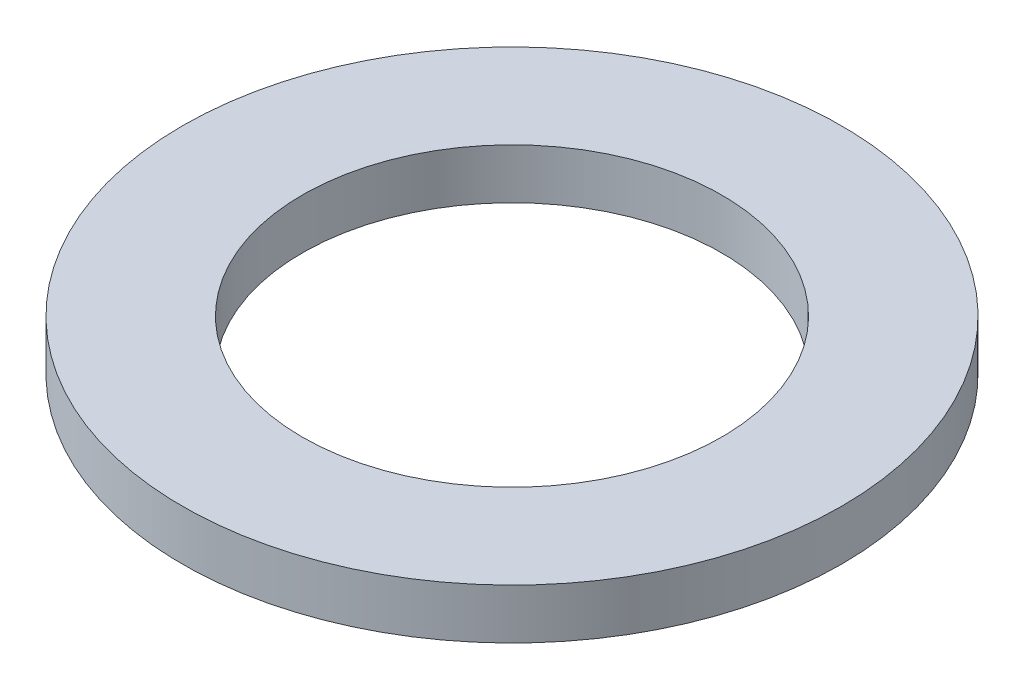
ISO-10303-21;
HEADER;
FILE_DESCRIPTION(('STEP AP214'),'2;1');
FILE_NAME('part.step','',(''),(''),'','','');
FILE_SCHEMA(('AUTOMOTIVE_DESIGN { 1 0 10303 214 1 1 1 1 }'));
ENDSEC;
DATA;
#1=APPLICATION_CONTEXT('core data for automotive mechanical design processes');
#2=APPLICATION_PROTOCOL_DEFINITION('international standard','automotive_design',2000,#1);
#3=PRODUCT_CONTEXT('',#1,'mechanical');
#4=PRODUCT('Part','Part','',(#3));
#5=PRODUCT_RELATED_PRODUCT_CATEGORY('part','',(#4));
#6=PRODUCT_DEFINITION_FORMATION('','',#4);
#7=PRODUCT_DEFINITION_CONTEXT('part definition',#1,'design');
#8=PRODUCT_DEFINITION('design','',#6,#7);
#9=PRODUCT_DEFINITION_SHAPE('','',#8);
#10=(LENGTH_UNIT() NAMED_UNIT(*) SI_UNIT(.MILLI.,.METRE.));
#11=(NAMED_UNIT(*) PLANE_ANGLE_UNIT() SI_UNIT($,.RADIAN.));
#12=(NAMED_UNIT(*) SI_UNIT($,.STERADIAN.) SOLID_ANGLE_UNIT());
#13=UNCERTAINTY_MEASURE_WITH_UNIT(LENGTH_MEASURE(1.E-05),#10,'distance_accuracy_value','');
#14=(GEOMETRIC_REPRESENTATION_CONTEXT(3) GLOBAL_UNCERTAINTY_ASSIGNED_CONTEXT((#13)) GLOBAL_UNIT_ASSIGNED_CONTEXT((#10,
#11,#12)) REPRESENTATION_CONTEXT('',''));
#15=CARTESIAN_POINT('',(0.,0.,0.));
#16=DIRECTION('',(0.,0.,1.));
#17=DIRECTION('',(1.,0.,0.));
#18=AXIS2_PLACEMENT_3D('',#15,#16,#17);
#19=CARTESIAN_POINT('',(0.,3.35,0.));
#20=DIRECTION('',(0.,1.,0.));
#21=DIRECTION('',(0.,0.,1.));
#22=AXIS2_PLACEMENT_3D('',#19,#20,#21);
#23=PLANE('',#22);
#24=CARTESIAN_POINT('',(0.,3.35,0.));
#25=DIRECTION('',(0.,1.,0.));
#26=DIRECTION('',(1.,0.,0.));
#27=AXIS2_PLACEMENT_3D('',#24,#25,#26);
#28=CIRCLE('',#27,22.);
#29=CARTESIAN_POINT('',(22.,3.35,0.));
#30=VERTEX_POINT('',#29);
#31=EDGE_CURVE('E11',#30,#30,#28,.T.);
#32=ORIENTED_EDGE('',*,*,#31,.T.);
#33=EDGE_LOOP('',(#32));
#34=FACE_BOUND('',#33,.T.);
#35=CARTESIAN_POINT('',(0.,3.35,0.));
#36=DIRECTION('',(0.,1.,0.));
#37=DIRECTION('',(0.,0.,1.));
#38=AXIS2_PLACEMENT_3D('',#35,#36,#37);
#39=CIRCLE('',#38,14.);
#40=CARTESIAN_POINT('',(0.,3.35,14.));
#41=VERTEX_POINT('',#40);
#42=EDGE_CURVE('E60',#41,#41,#39,.T.);
#43=ORIENTED_EDGE('',*,*,#42,.F.);
#44=EDGE_LOOP('',(#43));
#45=FACE_BOUND('',#44,.T.);
#46=ADVANCED_FACE('F47',(#34,#45),#23,.T.);
#47=CARTESIAN_POINT('',(0.,0.,0.));
#48=DIRECTION('',(0.,1.,0.));
#49=DIRECTION('',(0.,0.,1.));
#50=AXIS2_PLACEMENT_3D('',#47,#48,#49);
#51=PLANE('',#50);
#52=CARTESIAN_POINT('',(0.,0.,0.));
#53=DIRECTION('',(0.,1.,0.));
#54=DIRECTION('',(1.,0.,0.));
#55=AXIS2_PLACEMENT_3D('',#52,#53,#54);
#56=CIRCLE('',#55,22.);
#57=CARTESIAN_POINT('',(22.,0.,0.));
#58=VERTEX_POINT('',#57);
#59=EDGE_CURVE('E51',#58,#58,#56,.T.);
#60=ORIENTED_EDGE('',*,*,#59,.F.);
#61=EDGE_LOOP('',(#60));
#62=FACE_BOUND('',#61,.T.);
#63=CARTESIAN_POINT('',(0.,0.,0.));
#64=DIRECTION('',(0.,1.,0.));
#65=DIRECTION('',(0.,0.,1.));
#66=AXIS2_PLACEMENT_3D('',#63,#64,#65);
#67=CIRCLE('',#66,14.);
#68=CARTESIAN_POINT('',(0.,0.,14.));
#69=VERTEX_POINT('',#68);
#70=EDGE_CURVE('E62',#69,#69,#67,.T.);
#71=ORIENTED_EDGE('',*,*,#70,.T.);
#72=EDGE_LOOP('',(#71));
#73=FACE_BOUND('',#72,.T.);
#74=ADVANCED_FACE('F74',(#62,#73),#51,.F.);
#75=CARTESIAN_POINT('',(0.,3.35,0.));
#76=DIRECTION('',(0.,-1.,0.));
#77=DIRECTION('',(0.,0.,-1.));
#78=AXIS2_PLACEMENT_3D('',#75,#76,#77);
#79=CYLINDRICAL_SURFACE('',#78,22.);
#80=ORIENTED_EDGE('',*,*,#31,.F.);
#81=EDGE_LOOP('',(#80));
#82=FACE_BOUND('',#81,.T.);
#83=ORIENTED_EDGE('',*,*,#59,.T.);
#84=EDGE_LOOP('',(#83));
#85=FACE_BOUND('',#84,.T.);
#86=ADVANCED_FACE('F49',(#82,#85),#79,.T.);
#87=CARTESIAN_POINT('',(0.,3.35,0.));
#88=DIRECTION('',(0.,-1.,0.));
#89=DIRECTION('',(0.,0.,-1.));
#90=AXIS2_PLACEMENT_3D('',#87,#88,#89);
#91=CYLINDRICAL_SURFACE('',#90,14.);
#92=ORIENTED_EDGE('',*,*,#42,.T.);
#93=EDGE_LOOP('',(#92));
#94=FACE_BOUND('',#93,.T.);
#95=ORIENTED_EDGE('',*,*,#70,.F.);
#96=EDGE_LOOP('',(#95));
#97=FACE_BOUND('',#96,.T.);
#98=ADVANCED_FACE('F70',(#94,#97),#91,.F.);
#99=CLOSED_SHELL('',(#46,#74,#86,#98));
#100=MANIFOLD_SOLID_BREP('B2',#99);
#101=ADVANCED_BREP_SHAPE_REPRESENTATION('',(#18,#100),#14);
#102=SHAPE_DEFINITION_REPRESENTATION(#9,#101);
ENDSEC;
END-ISO-10303-21;
